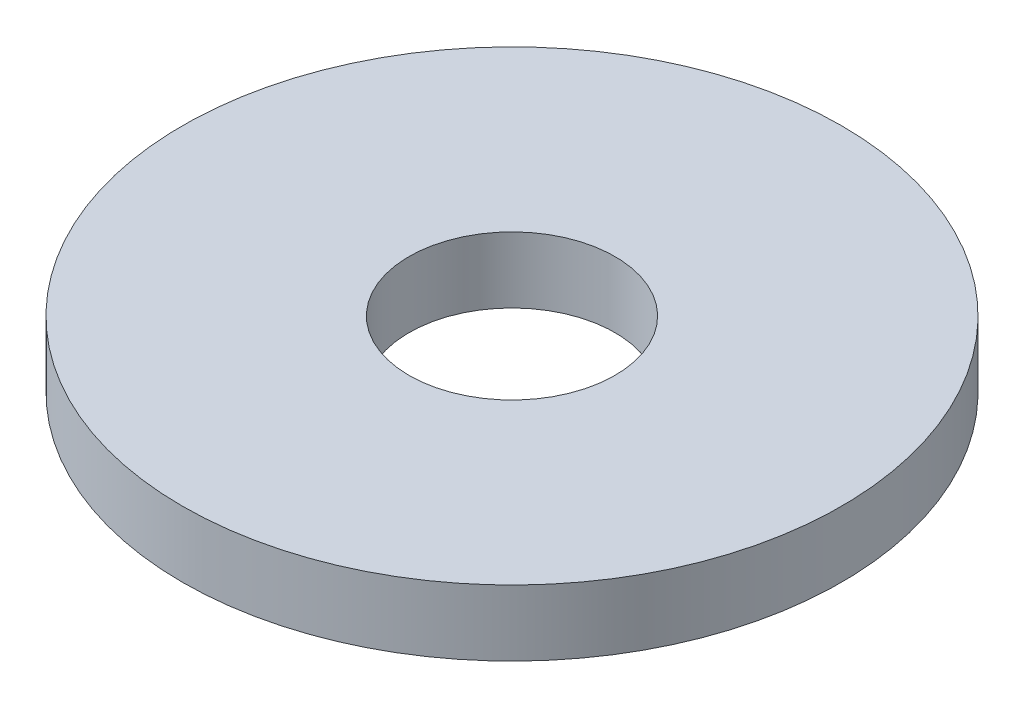
ISO-10303-21;
HEADER;
FILE_DESCRIPTION(('STEP AP214'),'2;1');
FILE_NAME('part.step','',(''),(''),'','','');
FILE_SCHEMA(('AUTOMOTIVE_DESIGN { 1 0 10303 214 1 1 1 1 }'));
ENDSEC;
DATA;
#1=APPLICATION_CONTEXT('core data for automotive mechanical design processes');
#2=APPLICATION_PROTOCOL_DEFINITION('international standard','automotive_design',2000,#1);
#3=PRODUCT_CONTEXT('',#1,'mechanical');
#4=PRODUCT('Part','Part','',(#3));
#5=PRODUCT_RELATED_PRODUCT_CATEGORY('part','',(#4));
#6=PRODUCT_DEFINITION_FORMATION('','',#4);
#7=PRODUCT_DEFINITION_CONTEXT('part definition',#1,'design');
#8=PRODUCT_DEFINITION('design','',#6,#7);
#9=PRODUCT_DEFINITION_SHAPE('','',#8);
#10=(LENGTH_UNIT() NAMED_UNIT(*) SI_UNIT(.MILLI.,.METRE.));
#11=(NAMED_UNIT(*) PLANE_ANGLE_UNIT() SI_UNIT($,.RADIAN.));
#12=(NAMED_UNIT(*) SI_UNIT($,.STERADIAN.) SOLID_ANGLE_UNIT());
#13=UNCERTAINTY_MEASURE_WITH_UNIT(LENGTH_MEASURE(1.E-05),#10,'distance_accuracy_value','');
#14=(GEOMETRIC_REPRESENTATION_CONTEXT(3) GLOBAL_UNCERTAINTY_ASSIGNED_CONTEXT((#13)) GLOBAL_UNIT_ASSIGNED_CONTEXT((#10,
#11,#12)) REPRESENTATION_CONTEXT('',''));
#15=CARTESIAN_POINT('',(0.,0.,0.));
#16=DIRECTION('',(0.,0.,1.));
#17=DIRECTION('',(1.,0.,0.));
#18=AXIS2_PLACEMENT_3D('',#15,#16,#17);
#19=CARTESIAN_POINT('',(0.,1.5875,0.));
#20=DIRECTION('',(0.,1.,0.));
#21=DIRECTION('',(0.,0.,1.));
#22=AXIS2_PLACEMENT_3D('',#19,#20,#21);
#23=PLANE('',#22);
#24=CARTESIAN_POINT('',(0.,1.5875,0.));
#25=DIRECTION('',(0.,1.,0.));
#26=DIRECTION('',(0.,0.,1.));
#27=AXIS2_PLACEMENT_3D('',#24,#25,#26);
#28=CIRCLE('',#27,15.875);
#29=CARTESIAN_POINT('',(0.,1.5875,15.875));
#30=VERTEX_POINT('',#29);
#31=EDGE_CURVE('E10',#30,#30,#28,.T.);
#32=ORIENTED_EDGE('',*,*,#31,.T.);
#33=EDGE_LOOP('',(#32));
#34=FACE_BOUND('',#33,.T.);
#35=CARTESIAN_POINT('',(0.,1.5875,0.));
#36=DIRECTION('',(0.,1.,0.));
#37=DIRECTION('',(0.,0.,1.));
#38=AXIS2_PLACEMENT_3D('',#35,#36,#37);
#39=CIRCLE('',#38,4.9609375);
#40=CARTESIAN_POINT('',(0.,1.5875,4.9609375));
#41=VERTEX_POINT('',#40);
#42=EDGE_CURVE('E41',#41,#41,#39,.T.);
#43=ORIENTED_EDGE('',*,*,#42,.F.);
#44=EDGE_LOOP('',(#43));
#45=FACE_BOUND('',#44,.T.);
#46=ADVANCED_FACE('F30',(#34,#45),#23,.T.);
#47=CARTESIAN_POINT('',(0.,-1.5875,0.));
#48=DIRECTION('',(0.,1.,0.));
#49=DIRECTION('',(0.,0.,1.));
#50=AXIS2_PLACEMENT_3D('',#47,#48,#49);
#51=PLANE('',#50);
#52=CARTESIAN_POINT('',(0.,-1.5875,0.));
#53=DIRECTION('',(0.,1.,0.));
#54=DIRECTION('',(0.,0.,1.));
#55=AXIS2_PLACEMENT_3D('',#52,#53,#54);
#56=CIRCLE('',#55,15.875);
#57=CARTESIAN_POINT('',(0.,-1.5875,15.875));
#58=VERTEX_POINT('',#57);
#59=EDGE_CURVE('E34',#58,#58,#56,.T.);
#60=ORIENTED_EDGE('',*,*,#59,.F.);
#61=EDGE_LOOP('',(#60));
#62=FACE_BOUND('',#61,.T.);
#63=CARTESIAN_POINT('',(0.,-1.5875,0.));
#64=DIRECTION('',(0.,1.,0.));
#65=DIRECTION('',(0.,0.,1.));
#66=AXIS2_PLACEMENT_3D('',#63,#64,#65);
#67=CIRCLE('',#66,4.9609375);
#68=CARTESIAN_POINT('',(0.,-1.5875,4.9609375));
#69=VERTEX_POINT('',#68);
#70=EDGE_CURVE('E43',#69,#69,#67,.T.);
#71=ORIENTED_EDGE('',*,*,#70,.T.);
#72=EDGE_LOOP('',(#71));
#73=FACE_BOUND('',#72,.T.);
#74=ADVANCED_FACE('F53',(#62,#73),#51,.F.);
#75=CARTESIAN_POINT('',(0.,1.5875,0.));
#76=DIRECTION('',(0.,-1.,0.));
#77=DIRECTION('',(0.,0.,-1.));
#78=AXIS2_PLACEMENT_3D('',#75,#76,#77);
#79=CYLINDRICAL_SURFACE('',#78,15.875);
#80=ORIENTED_EDGE('',*,*,#31,.F.);
#81=EDGE_LOOP('',(#80));
#82=FACE_BOUND('',#81,.T.);
#83=ORIENTED_EDGE('',*,*,#59,.T.);
#84=EDGE_LOOP('',(#83));
#85=FACE_BOUND('',#84,.T.);
#86=ADVANCED_FACE('F32',(#82,#85),#79,.T.);
#87=CARTESIAN_POINT('',(0.,1.5875,0.));
#88=DIRECTION('',(0.,-1.,0.));
#89=DIRECTION('',(0.,0.,-1.));
#90=AXIS2_PLACEMENT_3D('',#87,#88,#89);
#91=CYLINDRICAL_SURFACE('',#90,4.9609375);
#92=ORIENTED_EDGE('',*,*,#42,.T.);
#93=EDGE_LOOP('',(#92));
#94=FACE_BOUND('',#93,.T.);
#95=ORIENTED_EDGE('',*,*,#70,.F.);
#96=EDGE_LOOP('',(#95));
#97=FACE_BOUND('',#96,.T.);
#98=ADVANCED_FACE('F49',(#94,#97),#91,.F.);
#99=CLOSED_SHELL('',(#46,#74,#86,#98));
#100=MANIFOLD_SOLID_BREP('B2',#99);
#101=ADVANCED_BREP_SHAPE_REPRESENTATION('',(#18,#100),#14);
#102=SHAPE_DEFINITION_REPRESENTATION(#9,#101);
ENDSEC;
END-ISO-10303-21;
